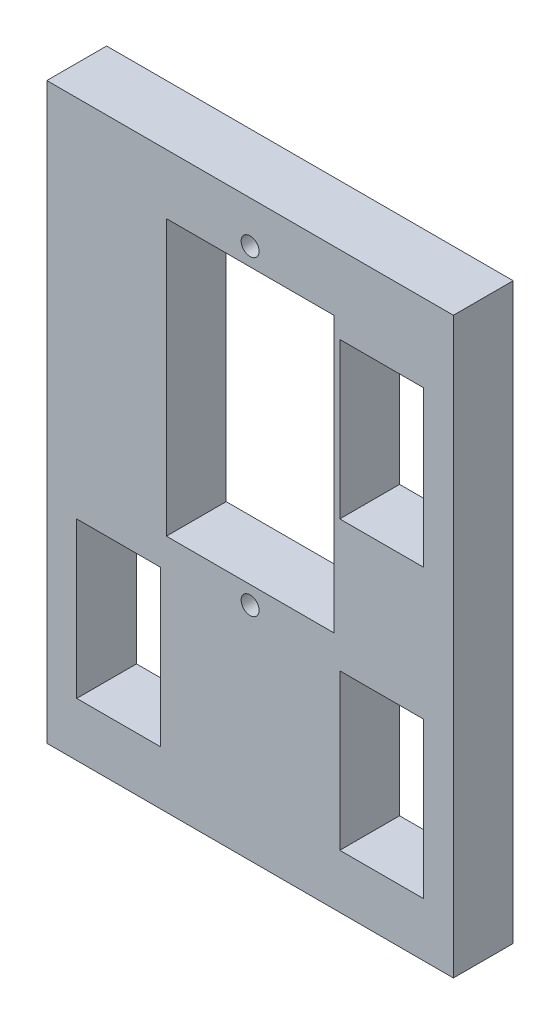
ISO-10303-21;
HEADER;
FILE_DESCRIPTION(('STEP AP214'),'2;1');
FILE_NAME('part.step','',(''),(''),'','','');
FILE_SCHEMA(('AUTOMOTIVE_DESIGN { 1 0 10303 214 1 1 1 1 }'));
ENDSEC;
DATA;
#1=APPLICATION_CONTEXT('core data for automotive mechanical design processes');
#2=APPLICATION_PROTOCOL_DEFINITION('international standard','automotive_design',2000,#1);
#3=PRODUCT_CONTEXT('',#1,'mechanical');
#4=PRODUCT('Part','Part','',(#3));
#5=PRODUCT_RELATED_PRODUCT_CATEGORY('part','',(#4));
#6=PRODUCT_DEFINITION_FORMATION('','',#4);
#7=PRODUCT_DEFINITION_CONTEXT('part definition',#1,'design');
#8=PRODUCT_DEFINITION('design','',#6,#7);
#9=PRODUCT_DEFINITION_SHAPE('','',#8);
#10=(LENGTH_UNIT() NAMED_UNIT(*) SI_UNIT(.MILLI.,.METRE.));
#11=(NAMED_UNIT(*) PLANE_ANGLE_UNIT() SI_UNIT($,.RADIAN.));
#12=(NAMED_UNIT(*) SI_UNIT($,.STERADIAN.) SOLID_ANGLE_UNIT());
#13=UNCERTAINTY_MEASURE_WITH_UNIT(LENGTH_MEASURE(1.E-05),#10,'distance_accuracy_value','');
#14=(GEOMETRIC_REPRESENTATION_CONTEXT(3) GLOBAL_UNCERTAINTY_ASSIGNED_CONTEXT((#13)) GLOBAL_UNIT_ASSIGNED_CONTEXT((#10,
#11,#12)) REPRESENTATION_CONTEXT('',''));
#15=CARTESIAN_POINT('',(0.,0.,0.));
#16=DIRECTION('',(0.,0.,1.));
#17=DIRECTION('',(1.,0.,0.));
#18=AXIS2_PLACEMENT_3D('',#15,#16,#17);
#19=CARTESIAN_POINT('',(0.,0.,5.));
#20=DIRECTION('',(0.,0.,-1.));
#21=DIRECTION('',(-1.,0.,0.));
#22=AXIS2_PLACEMENT_3D('',#19,#20,#21);
#23=PLANE('',#22);
#24=DIRECTION('',(0.,1.,0.));
#25=VECTOR('',#24,1.);
#26=CARTESIAN_POINT('',(31.5,28.5,5.));
#27=LINE('',#26,#25);
#28=CARTESIAN_POINT('',(31.5,28.5,5.));
#29=VERTEX_POINT('',#28);
#30=CARTESIAN_POINT('',(31.5,41.5,5.));
#31=VERTEX_POINT('',#30);
#32=EDGE_CURVE('E206',#29,#31,#27,.T.);
#33=ORIENTED_EDGE('',*,*,#32,.F.);
#34=DIRECTION('',(1.,0.,0.));
#35=VECTOR('',#34,1.);
#36=CARTESIAN_POINT('',(31.5,28.5,5.));
#37=LINE('',#36,#35);
#38=CARTESIAN_POINT('',(24.5,28.5,5.));
#39=VERTEX_POINT('',#38);
#40=EDGE_CURVE('E214',#39,#29,#37,.T.);
#41=ORIENTED_EDGE('',*,*,#40,.F.);
#42=DIRECTION('',(0.,-1.,0.));
#43=VECTOR('',#42,1.);
#44=CARTESIAN_POINT('',(24.5,28.5,5.));
#45=LINE('',#44,#43);
#46=CARTESIAN_POINT('',(24.5,41.5,5.));
#47=VERTEX_POINT('',#46);
#48=EDGE_CURVE('E211',#47,#39,#45,.T.);
#49=ORIENTED_EDGE('',*,*,#48,.F.);
#50=DIRECTION('',(-1.,0.,0.));
#51=VECTOR('',#50,1.);
#52=CARTESIAN_POINT('',(31.5,41.5,5.));
#53=LINE('',#52,#51);
#54=EDGE_CURVE('E208',#31,#47,#53,.T.);
#55=ORIENTED_EDGE('',*,*,#54,.F.);
#56=EDGE_LOOP('',(#33,#41,#49,#55));
#57=FACE_BOUND('',#56,.T.);
#58=CARTESIAN_POINT('',(17.,44.5,5.));
#59=DIRECTION('',(0.,0.,1.));
#60=DIRECTION('',(1.,0.,0.));
#61=AXIS2_PLACEMENT_3D('',#58,#59,#60);
#62=CIRCLE('',#61,0.750000000000002);
#63=CARTESIAN_POINT('',(17.75,44.5,5.));
#64=VERTEX_POINT('',#63);
#65=EDGE_CURVE('E268',#64,#64,#62,.T.);
#66=ORIENTED_EDGE('',*,*,#65,.F.);
#67=EDGE_LOOP('',(#66));
#68=FACE_BOUND('',#67,.T.);
#69=CARTESIAN_POINT('',(17.,18.5,5.));
#70=DIRECTION('',(0.,0.,1.));
#71=DIRECTION('',(1.,0.,0.));
#72=AXIS2_PLACEMENT_3D('',#69,#70,#71);
#73=CIRCLE('',#72,0.750000000000002);
#74=CARTESIAN_POINT('',(17.75,18.5,5.));
#75=VERTEX_POINT('',#74);
#76=EDGE_CURVE('E274',#75,#75,#73,.T.);
#77=ORIENTED_EDGE('',*,*,#76,.F.);
#78=EDGE_LOOP('',(#77));
#79=FACE_BOUND('',#78,.T.);
#80=DIRECTION('',(0.,-1.,0.));
#81=VECTOR('',#80,1.);
#82=CARTESIAN_POINT('',(10.,20.,5.));
#83=LINE('',#82,#81);
#84=CARTESIAN_POINT('',(10.,43.,5.));
#85=VERTEX_POINT('',#84);
#86=CARTESIAN_POINT('',(10.,20.,5.));
#87=VERTEX_POINT('',#86);
#88=EDGE_CURVE('E280',#85,#87,#83,.T.);
#89=ORIENTED_EDGE('',*,*,#88,.F.);
#90=DIRECTION('',(-1.,0.,0.));
#91=VECTOR('',#90,1.);
#92=CARTESIAN_POINT('',(24.,43.,5.));
#93=LINE('',#92,#91);
#94=CARTESIAN_POINT('',(24.,43.,5.));
#95=VERTEX_POINT('',#94);
#96=EDGE_CURVE('E288',#95,#85,#93,.T.);
#97=ORIENTED_EDGE('',*,*,#96,.F.);
#98=DIRECTION('',(0.,1.,0.));
#99=VECTOR('',#98,1.);
#100=CARTESIAN_POINT('',(24.,20.,5.));
#101=LINE('',#100,#99);
#102=CARTESIAN_POINT('',(24.,20.,5.));
#103=VERTEX_POINT('',#102);
#104=EDGE_CURVE('E285',#103,#95,#101,.T.);
#105=ORIENTED_EDGE('',*,*,#104,.F.);
#106=DIRECTION('',(1.,0.,0.));
#107=VECTOR('',#106,1.);
#108=CARTESIAN_POINT('',(24.,20.,5.));
#109=LINE('',#108,#107);
#110=EDGE_CURVE('E282',#87,#103,#109,.T.);
#111=ORIENTED_EDGE('',*,*,#110,.F.);
#112=EDGE_LOOP('',(#89,#97,#105,#111));
#113=FACE_BOUND('',#112,.T.);
#114=DIRECTION('',(0.,-1.,0.));
#115=VECTOR('',#114,1.);
#116=CARTESIAN_POINT('',(0.,0.,5.));
#117=LINE('',#116,#115);
#118=CARTESIAN_POINT('',(0.,48.,5.));
#119=VERTEX_POINT('',#118);
#120=CARTESIAN_POINT('',(0.,0.,5.));
#121=VERTEX_POINT('',#120);
#122=EDGE_CURVE('E311',#119,#121,#117,.T.);
#123=ORIENTED_EDGE('',*,*,#122,.T.);
#124=DIRECTION('',(1.,0.,0.));
#125=VECTOR('',#124,1.);
#126=CARTESIAN_POINT('',(0.,0.,5.));
#127=LINE('',#126,#125);
#128=CARTESIAN_POINT('',(34.,0.,5.));
#129=VERTEX_POINT('',#128);
#130=EDGE_CURVE('E314',#121,#129,#127,.T.);
#131=ORIENTED_EDGE('',*,*,#130,.T.);
#132=DIRECTION('',(0.,1.,0.));
#133=VECTOR('',#132,1.);
#134=CARTESIAN_POINT('',(34.,0.,5.));
#135=LINE('',#134,#133);
#136=CARTESIAN_POINT('',(34.,48.,5.));
#137=VERTEX_POINT('',#136);
#138=EDGE_CURVE('E317',#129,#137,#135,.T.);
#139=ORIENTED_EDGE('',*,*,#138,.T.);
#140=DIRECTION('',(-1.,0.,0.));
#141=VECTOR('',#140,1.);
#142=CARTESIAN_POINT('',(0.,48.,5.));
#143=LINE('',#142,#141);
#144=EDGE_CURVE('E319',#137,#119,#143,.T.);
#145=ORIENTED_EDGE('',*,*,#144,.T.);
#146=EDGE_LOOP('',(#123,#131,#139,#145));
#147=FACE_BOUND('',#146,.T.);
#148=DIRECTION('',(0.,1.,0.));
#149=VECTOR('',#148,1.);
#150=CARTESIAN_POINT('',(31.5,4.5,5.));
#151=LINE('',#150,#149);
#152=CARTESIAN_POINT('',(31.5,4.5,5.));
#153=VERTEX_POINT('',#152);
#154=CARTESIAN_POINT('',(31.5,17.5,5.));
#155=VERTEX_POINT('',#154);
#156=EDGE_CURVE('E237',#153,#155,#151,.T.);
#157=ORIENTED_EDGE('',*,*,#156,.F.);
#158=DIRECTION('',(1.,0.,0.));
#159=VECTOR('',#158,1.);
#160=CARTESIAN_POINT('',(31.5,4.5,5.));
#161=LINE('',#160,#159);
#162=CARTESIAN_POINT('',(24.5,4.5,5.));
#163=VERTEX_POINT('',#162);
#164=EDGE_CURVE('E245',#163,#153,#161,.T.);
#165=ORIENTED_EDGE('',*,*,#164,.F.);
#166=DIRECTION('',(0.,-1.,0.));
#167=VECTOR('',#166,1.);
#168=CARTESIAN_POINT('',(24.5,4.5,5.));
#169=LINE('',#168,#167);
#170=CARTESIAN_POINT('',(24.5,17.5,5.));
#171=VERTEX_POINT('',#170);
#172=EDGE_CURVE('E242',#171,#163,#169,.T.);
#173=ORIENTED_EDGE('',*,*,#172,.F.);
#174=DIRECTION('',(-1.,0.,0.));
#175=VECTOR('',#174,1.);
#176=CARTESIAN_POINT('',(31.5,17.5,5.));
#177=LINE('',#176,#175);
#178=EDGE_CURVE('E239',#155,#171,#177,.T.);
#179=ORIENTED_EDGE('',*,*,#178,.F.);
#180=EDGE_LOOP('',(#157,#165,#173,#179));
#181=FACE_BOUND('',#180,.T.);
#182=DIRECTION('',(0.,1.,0.));
#183=VECTOR('',#182,1.);
#184=CARTESIAN_POINT('',(9.5,4.5,5.));
#185=LINE('',#184,#183);
#186=CARTESIAN_POINT('',(9.5,4.5,5.));
#187=VERTEX_POINT('',#186);
#188=CARTESIAN_POINT('',(9.49999999999999,17.5,5.));
#189=VERTEX_POINT('',#188);
#190=EDGE_CURVE('E170',#187,#189,#185,.T.);
#191=ORIENTED_EDGE('',*,*,#190,.F.);
#192=DIRECTION('',(1.,0.,0.));
#193=VECTOR('',#192,1.);
#194=CARTESIAN_POINT('',(9.5,4.5,5.));
#195=LINE('',#194,#193);
#196=CARTESIAN_POINT('',(2.5,4.5,5.));
#197=VERTEX_POINT('',#196);
#198=EDGE_CURVE('E192',#197,#187,#195,.T.);
#199=ORIENTED_EDGE('',*,*,#198,.F.);
#200=DIRECTION('',(0.,-1.,0.));
#201=VECTOR('',#200,1.);
#202=CARTESIAN_POINT('',(2.5,4.5,5.));
#203=LINE('',#202,#201);
#204=CARTESIAN_POINT('',(2.5,17.5,5.));
#205=VERTEX_POINT('',#204);
#206=EDGE_CURVE('E190',#205,#197,#203,.T.);
#207=ORIENTED_EDGE('',*,*,#206,.F.);
#208=DIRECTION('',(-1.,0.,0.));
#209=VECTOR('',#208,1.);
#210=CARTESIAN_POINT('',(9.49999999999999,17.5,5.));
#211=LINE('',#210,#209);
#212=EDGE_CURVE('E178',#189,#205,#211,.T.);
#213=ORIENTED_EDGE('',*,*,#212,.F.);
#214=EDGE_LOOP('',(#191,#199,#207,#213));
#215=FACE_BOUND('',#214,.T.);
#216=ADVANCED_FACE('F33',(#57,#68,#79,#113,#147,#181,#215),#23,.F.);
#217=CARTESIAN_POINT('',(0.,0.,0.));
#218=DIRECTION('',(0.,0.,-1.));
#219=DIRECTION('',(-1.,0.,0.));
#220=AXIS2_PLACEMENT_3D('',#217,#218,#219);
#221=PLANE('',#220);
#222=CARTESIAN_POINT('',(17.,18.5,0.));
#223=DIRECTION('',(0.,0.,1.));
#224=DIRECTION('',(1.,0.,0.));
#225=AXIS2_PLACEMENT_3D('',#222,#223,#224);
#226=CIRCLE('',#225,0.750000000000002);
#227=CARTESIAN_POINT('',(17.75,18.5,0.));
#228=VERTEX_POINT('',#227);
#229=EDGE_CURVE('E271',#228,#228,#226,.T.);
#230=ORIENTED_EDGE('',*,*,#229,.T.);
#231=EDGE_LOOP('',(#230));
#232=FACE_BOUND('',#231,.T.);
#233=DIRECTION('',(0.,-1.,0.));
#234=VECTOR('',#233,1.);
#235=CARTESIAN_POINT('',(0.,0.,0.));
#236=LINE('',#235,#234);
#237=CARTESIAN_POINT('',(0.,48.,0.));
#238=VERTEX_POINT('',#237);
#239=CARTESIAN_POINT('',(0.,0.,0.));
#240=VERTEX_POINT('',#239);
#241=EDGE_CURVE('E310',#238,#240,#236,.T.);
#242=ORIENTED_EDGE('',*,*,#241,.F.);
#243=DIRECTION('',(-1.,0.,0.));
#244=VECTOR('',#243,1.);
#245=CARTESIAN_POINT('',(0.,48.,0.));
#246=LINE('',#245,#244);
#247=CARTESIAN_POINT('',(34.,48.,0.));
#248=VERTEX_POINT('',#247);
#249=EDGE_CURVE('E315',#248,#238,#246,.T.);
#250=ORIENTED_EDGE('',*,*,#249,.F.);
#251=DIRECTION('',(0.,1.,0.));
#252=VECTOR('',#251,1.);
#253=CARTESIAN_POINT('',(34.,0.,0.));
#254=LINE('',#253,#252);
#255=CARTESIAN_POINT('',(34.,0.,0.));
#256=VERTEX_POINT('',#255);
#257=EDGE_CURVE('E326',#256,#248,#254,.T.);
#258=ORIENTED_EDGE('',*,*,#257,.F.);
#259=DIRECTION('',(1.,0.,0.));
#260=VECTOR('',#259,1.);
#261=CARTESIAN_POINT('',(0.,0.,0.));
#262=LINE('',#261,#260);
#263=EDGE_CURVE('E324',#240,#256,#262,.T.);
#264=ORIENTED_EDGE('',*,*,#263,.F.);
#265=EDGE_LOOP('',(#242,#250,#258,#264));
#266=FACE_BOUND('',#265,.T.);
#267=DIRECTION('',(-1.,0.,0.));
#268=VECTOR('',#267,1.);
#269=CARTESIAN_POINT('',(24.,43.,0.));
#270=LINE('',#269,#268);
#271=CARTESIAN_POINT('',(24.,43.,0.));
#272=VERTEX_POINT('',#271);
#273=CARTESIAN_POINT('',(10.,43.,0.));
#274=VERTEX_POINT('',#273);
#275=EDGE_CURVE('E283',#272,#274,#270,.T.);
#276=ORIENTED_EDGE('',*,*,#275,.T.);
#277=DIRECTION('',(0.,-1.,0.));
#278=VECTOR('',#277,1.);
#279=CARTESIAN_POINT('',(10.,20.,0.));
#280=LINE('',#279,#278);
#281=CARTESIAN_POINT('',(10.,20.,0.));
#282=VERTEX_POINT('',#281);
#283=EDGE_CURVE('E277',#274,#282,#280,.T.);
#284=ORIENTED_EDGE('',*,*,#283,.T.);
#285=DIRECTION('',(1.,0.,0.));
#286=VECTOR('',#285,1.);
#287=CARTESIAN_POINT('',(24.,20.,0.));
#288=LINE('',#287,#286);
#289=CARTESIAN_POINT('',(24.,20.,0.));
#290=VERTEX_POINT('',#289);
#291=EDGE_CURVE('E293',#282,#290,#288,.T.);
#292=ORIENTED_EDGE('',*,*,#291,.T.);
#293=DIRECTION('',(0.,1.,0.));
#294=VECTOR('',#293,1.);
#295=CARTESIAN_POINT('',(24.,20.,0.));
#296=LINE('',#295,#294);
#297=EDGE_CURVE('E296',#290,#272,#296,.T.);
#298=ORIENTED_EDGE('',*,*,#297,.T.);
#299=EDGE_LOOP('',(#276,#284,#292,#298));
#300=FACE_BOUND('',#299,.T.);
#301=CARTESIAN_POINT('',(17.,44.5,0.));
#302=DIRECTION('',(0.,0.,1.));
#303=DIRECTION('',(1.,0.,0.));
#304=AXIS2_PLACEMENT_3D('',#301,#302,#303);
#305=CIRCLE('',#304,0.750000000000002);
#306=CARTESIAN_POINT('',(17.75,44.5,0.));
#307=VERTEX_POINT('',#306);
#308=EDGE_CURVE('E267',#307,#307,#305,.T.);
#309=ORIENTED_EDGE('',*,*,#308,.T.);
#310=EDGE_LOOP('',(#309));
#311=FACE_BOUND('',#310,.T.);
#312=DIRECTION('',(1.,0.,0.));
#313=VECTOR('',#312,1.);
#314=CARTESIAN_POINT('',(31.5,4.5,0.));
#315=LINE('',#314,#313);
#316=CARTESIAN_POINT('',(24.5,4.5,0.));
#317=VERTEX_POINT('',#316);
#318=CARTESIAN_POINT('',(31.5,4.5,0.));
#319=VERTEX_POINT('',#318);
#320=EDGE_CURVE('E240',#317,#319,#315,.T.);
#321=ORIENTED_EDGE('',*,*,#320,.T.);
#322=DIRECTION('',(0.,1.,0.));
#323=VECTOR('',#322,1.);
#324=CARTESIAN_POINT('',(31.5,4.5,0.));
#325=LINE('',#324,#323);
#326=CARTESIAN_POINT('',(31.5,17.5,0.));
#327=VERTEX_POINT('',#326);
#328=EDGE_CURVE('E236',#319,#327,#325,.T.);
#329=ORIENTED_EDGE('',*,*,#328,.T.);
#330=DIRECTION('',(-1.,0.,0.));
#331=VECTOR('',#330,1.);
#332=CARTESIAN_POINT('',(31.5,17.5,0.));
#333=LINE('',#332,#331);
#334=CARTESIAN_POINT('',(24.5,17.5,0.));
#335=VERTEX_POINT('',#334);
#336=EDGE_CURVE('E250',#327,#335,#333,.T.);
#337=ORIENTED_EDGE('',*,*,#336,.T.);
#338=DIRECTION('',(0.,-1.,0.));
#339=VECTOR('',#338,1.);
#340=CARTESIAN_POINT('',(24.5,4.5,0.));
#341=LINE('',#340,#339);
#342=EDGE_CURVE('E253',#335,#317,#341,.T.);
#343=ORIENTED_EDGE('',*,*,#342,.T.);
#344=EDGE_LOOP('',(#321,#329,#337,#343));
#345=FACE_BOUND('',#344,.T.);
#346=DIRECTION('',(1.,0.,0.));
#347=VECTOR('',#346,1.);
#348=CARTESIAN_POINT('',(31.5,28.5,0.));
#349=LINE('',#348,#347);
#350=CARTESIAN_POINT('',(24.5,28.5,0.));
#351=VERTEX_POINT('',#350);
#352=CARTESIAN_POINT('',(31.5,28.5,0.));
#353=VERTEX_POINT('',#352);
#354=EDGE_CURVE('E209',#351,#353,#349,.T.);
#355=ORIENTED_EDGE('',*,*,#354,.T.);
#356=DIRECTION('',(0.,1.,0.));
#357=VECTOR('',#356,1.);
#358=CARTESIAN_POINT('',(31.5,28.5,0.));
#359=LINE('',#358,#357);
#360=CARTESIAN_POINT('',(31.5,41.5,0.));
#361=VERTEX_POINT('',#360);
#362=EDGE_CURVE('E186',#353,#361,#359,.T.);
#363=ORIENTED_EDGE('',*,*,#362,.T.);
#364=DIRECTION('',(-1.,0.,0.));
#365=VECTOR('',#364,1.);
#366=CARTESIAN_POINT('',(31.5,41.5,0.));
#367=LINE('',#366,#365);
#368=CARTESIAN_POINT('',(24.5,41.5,0.));
#369=VERTEX_POINT('',#368);
#370=EDGE_CURVE('E219',#361,#369,#367,.T.);
#371=ORIENTED_EDGE('',*,*,#370,.T.);
#372=DIRECTION('',(0.,-1.,0.));
#373=VECTOR('',#372,1.);
#374=CARTESIAN_POINT('',(24.5,28.5,0.));
#375=LINE('',#374,#373);
#376=EDGE_CURVE('E222',#369,#351,#375,.T.);
#377=ORIENTED_EDGE('',*,*,#376,.T.);
#378=EDGE_LOOP('',(#355,#363,#371,#377));
#379=FACE_BOUND('',#378,.T.);
#380=DIRECTION('',(1.,0.,0.));
#381=VECTOR('',#380,1.);
#382=CARTESIAN_POINT('',(9.5,4.5,0.));
#383=LINE('',#382,#381);
#384=CARTESIAN_POINT('',(2.5,4.5,0.));
#385=VERTEX_POINT('',#384);
#386=CARTESIAN_POINT('',(9.5,4.5,0.));
#387=VERTEX_POINT('',#386);
#388=EDGE_CURVE('E179',#385,#387,#383,.T.);
#389=ORIENTED_EDGE('',*,*,#388,.T.);
#390=DIRECTION('',(0.,1.,0.));
#391=VECTOR('',#390,1.);
#392=CARTESIAN_POINT('',(9.5,4.5,0.));
#393=LINE('',#392,#391);
#394=CARTESIAN_POINT('',(9.49999999999999,17.5,0.));
#395=VERTEX_POINT('',#394);
#396=EDGE_CURVE('E56',#387,#395,#393,.T.);
#397=ORIENTED_EDGE('',*,*,#396,.T.);
#398=DIRECTION('',(-1.,0.,0.));
#399=VECTOR('',#398,1.);
#400=CARTESIAN_POINT('',(9.49999999999999,17.5,0.));
#401=LINE('',#400,#399);
#402=CARTESIAN_POINT('',(2.5,17.5,0.));
#403=VERTEX_POINT('',#402);
#404=EDGE_CURVE('E185',#395,#403,#401,.T.);
#405=ORIENTED_EDGE('',*,*,#404,.T.);
#406=DIRECTION('',(0.,-1.,0.));
#407=VECTOR('',#406,1.);
#408=CARTESIAN_POINT('',(2.5,4.5,0.));
#409=LINE('',#408,#407);
#410=EDGE_CURVE('E198',#403,#385,#409,.T.);
#411=ORIENTED_EDGE('',*,*,#410,.T.);
#412=EDGE_LOOP('',(#389,#397,#405,#411));
#413=FACE_BOUND('',#412,.T.);
#414=ADVANCED_FACE('F344',(#232,#266,#300,#311,#345,#379,#413),#221,.T.);
#415=CARTESIAN_POINT('',(0.,0.,5.));
#416=DIRECTION('',(1.,0.,0.));
#417=DIRECTION('',(0.,0.,-1.));
#418=AXIS2_PLACEMENT_3D('',#415,#416,#417);
#419=PLANE('',#418);
#420=ORIENTED_EDGE('',*,*,#241,.T.);
#421=DIRECTION('',(0.,0.,-1.));
#422=VECTOR('',#421,1.);
#423=CARTESIAN_POINT('',(0.,0.,5.));
#424=LINE('',#423,#422);
#425=EDGE_CURVE('E11',#121,#240,#424,.T.);
#426=ORIENTED_EDGE('',*,*,#425,.F.);
#427=ORIENTED_EDGE('',*,*,#122,.F.);
#428=DIRECTION('',(0.,0.,-1.));
#429=VECTOR('',#428,1.);
#430=CARTESIAN_POINT('',(0.,48.,5.));
#431=LINE('',#430,#429);
#432=EDGE_CURVE('E321',#119,#238,#431,.T.);
#433=ORIENTED_EDGE('',*,*,#432,.T.);
#434=EDGE_LOOP('',(#420,#426,#427,#433));
#435=FACE_BOUND('',#434,.T.);
#436=ADVANCED_FACE('F35',(#435),#419,.F.);
#437=CARTESIAN_POINT('',(0.,0.,5.));
#438=DIRECTION('',(0.,1.,0.));
#439=DIRECTION('',(-1.,0.,0.));
#440=AXIS2_PLACEMENT_3D('',#437,#438,#439);
#441=PLANE('',#440);
#442=ORIENTED_EDGE('',*,*,#263,.T.);
#443=DIRECTION('',(0.,0.,-1.));
#444=VECTOR('',#443,1.);
#445=CARTESIAN_POINT('',(34.,0.,5.));
#446=LINE('',#445,#444);
#447=EDGE_CURVE('E41',#129,#256,#446,.T.);
#448=ORIENTED_EDGE('',*,*,#447,.F.);
#449=ORIENTED_EDGE('',*,*,#130,.F.);
#450=ORIENTED_EDGE('',*,*,#425,.T.);
#451=EDGE_LOOP('',(#442,#448,#449,#450));
#452=FACE_BOUND('',#451,.T.);
#453=ADVANCED_FACE('F355',(#452),#441,.F.);
#454=CARTESIAN_POINT('',(34.,0.,5.));
#455=DIRECTION('',(-1.,0.,0.));
#456=DIRECTION('',(0.,-1.,0.));
#457=AXIS2_PLACEMENT_3D('',#454,#455,#456);
#458=PLANE('',#457);
#459=ORIENTED_EDGE('',*,*,#257,.T.);
#460=DIRECTION('',(0.,0.,-1.));
#461=VECTOR('',#460,1.);
#462=CARTESIAN_POINT('',(34.,48.,5.));
#463=LINE('',#462,#461);
#464=EDGE_CURVE('E331',#137,#248,#463,.T.);
#465=ORIENTED_EDGE('',*,*,#464,.F.);
#466=ORIENTED_EDGE('',*,*,#138,.F.);
#467=ORIENTED_EDGE('',*,*,#447,.T.);
#468=EDGE_LOOP('',(#459,#465,#466,#467));
#469=FACE_BOUND('',#468,.T.);
#470=ADVANCED_FACE('F338',(#469),#458,.F.);
#471=CARTESIAN_POINT('',(0.,48.,5.));
#472=DIRECTION('',(0.,-1.,0.));
#473=DIRECTION('',(1.,0.,0.));
#474=AXIS2_PLACEMENT_3D('',#471,#472,#473);
#475=PLANE('',#474);
#476=ORIENTED_EDGE('',*,*,#249,.T.);
#477=ORIENTED_EDGE('',*,*,#432,.F.);
#478=ORIENTED_EDGE('',*,*,#144,.F.);
#479=ORIENTED_EDGE('',*,*,#464,.T.);
#480=EDGE_LOOP('',(#476,#477,#478,#479));
#481=FACE_BOUND('',#480,.T.);
#482=ADVANCED_FACE('F348',(#481),#475,.F.);
#483=CARTESIAN_POINT('',(10.,20.,5.));
#484=DIRECTION('',(1.,0.,0.));
#485=DIRECTION('',(0.,0.,-1.));
#486=AXIS2_PLACEMENT_3D('',#483,#484,#485);
#487=PLANE('',#486);
#488=ORIENTED_EDGE('',*,*,#283,.F.);
#489=DIRECTION('',(0.,0.,-1.));
#490=VECTOR('',#489,1.);
#491=CARTESIAN_POINT('',(10.,43.,5.));
#492=LINE('',#491,#490);
#493=EDGE_CURVE('E290',#85,#274,#492,.T.);
#494=ORIENTED_EDGE('',*,*,#493,.F.);
#495=ORIENTED_EDGE('',*,*,#88,.T.);
#496=DIRECTION('',(0.,0.,-1.));
#497=VECTOR('',#496,1.);
#498=CARTESIAN_POINT('',(10.,20.,5.));
#499=LINE('',#498,#497);
#500=EDGE_CURVE('E307',#87,#282,#499,.T.);
#501=ORIENTED_EDGE('',*,*,#500,.T.);
#502=EDGE_LOOP('',(#488,#494,#495,#501));
#503=FACE_BOUND('',#502,.T.);
#504=ADVANCED_FACE('F373',(#503),#487,.T.);
#505=CARTESIAN_POINT('',(24.,20.,5.));
#506=DIRECTION('',(0.,1.,0.));
#507=DIRECTION('',(0.,0.,1.));
#508=AXIS2_PLACEMENT_3D('',#505,#506,#507);
#509=PLANE('',#508);
#510=ORIENTED_EDGE('',*,*,#291,.F.);
#511=ORIENTED_EDGE('',*,*,#500,.F.);
#512=ORIENTED_EDGE('',*,*,#110,.T.);
#513=DIRECTION('',(0.,0.,-1.));
#514=VECTOR('',#513,1.);
#515=CARTESIAN_POINT('',(24.,20.,5.));
#516=LINE('',#515,#514);
#517=EDGE_CURVE('E305',#103,#290,#516,.T.);
#518=ORIENTED_EDGE('',*,*,#517,.T.);
#519=EDGE_LOOP('',(#510,#511,#512,#518));
#520=FACE_BOUND('',#519,.T.);
#521=ADVANCED_FACE('F380',(#520),#509,.T.);
#522=CARTESIAN_POINT('',(24.,20.,5.));
#523=DIRECTION('',(-1.,0.,0.));
#524=DIRECTION('',(0.,0.,1.));
#525=AXIS2_PLACEMENT_3D('',#522,#523,#524);
#526=PLANE('',#525);
#527=ORIENTED_EDGE('',*,*,#297,.F.);
#528=ORIENTED_EDGE('',*,*,#517,.F.);
#529=ORIENTED_EDGE('',*,*,#104,.T.);
#530=DIRECTION('',(0.,0.,-1.));
#531=VECTOR('',#530,1.);
#532=CARTESIAN_POINT('',(24.,43.,5.));
#533=LINE('',#532,#531);
#534=EDGE_CURVE('E303',#95,#272,#533,.T.);
#535=ORIENTED_EDGE('',*,*,#534,.T.);
#536=EDGE_LOOP('',(#527,#528,#529,#535));
#537=FACE_BOUND('',#536,.T.);
#538=ADVANCED_FACE('F385',(#537),#526,.T.);
#539=CARTESIAN_POINT('',(24.,43.,5.));
#540=DIRECTION('',(0.,-1.,0.));
#541=DIRECTION('',(0.,0.,-1.));
#542=AXIS2_PLACEMENT_3D('',#539,#540,#541);
#543=PLANE('',#542);
#544=ORIENTED_EDGE('',*,*,#275,.F.);
#545=ORIENTED_EDGE('',*,*,#534,.F.);
#546=ORIENTED_EDGE('',*,*,#96,.T.);
#547=ORIENTED_EDGE('',*,*,#493,.T.);
#548=EDGE_LOOP('',(#544,#545,#546,#547));
#549=FACE_BOUND('',#548,.T.);
#550=ADVANCED_FACE('F392',(#549),#543,.T.);
#551=CARTESIAN_POINT('',(17.,18.5,5.));
#552=DIRECTION('',(0.,0.,-1.));
#553=DIRECTION('',(-1.,0.,0.));
#554=AXIS2_PLACEMENT_3D('',#551,#552,#553);
#555=CYLINDRICAL_SURFACE('',#554,0.750000000000002);
#556=ORIENTED_EDGE('',*,*,#76,.T.);
#557=EDGE_LOOP('',(#556));
#558=FACE_BOUND('',#557,.T.);
#559=ORIENTED_EDGE('',*,*,#229,.F.);
#560=EDGE_LOOP('',(#559));
#561=FACE_BOUND('',#560,.T.);
#562=ADVANCED_FACE('F406',(#558,#561),#555,.F.);
#563=CARTESIAN_POINT('',(17.,44.5,5.));
#564=DIRECTION('',(0.,0.,-1.));
#565=DIRECTION('',(-1.,0.,0.));
#566=AXIS2_PLACEMENT_3D('',#563,#564,#565);
#567=CYLINDRICAL_SURFACE('',#566,0.750000000000002);
#568=ORIENTED_EDGE('',*,*,#65,.T.);
#569=EDGE_LOOP('',(#568));
#570=FACE_BOUND('',#569,.T.);
#571=ORIENTED_EDGE('',*,*,#308,.F.);
#572=EDGE_LOOP('',(#571));
#573=FACE_BOUND('',#572,.T.);
#574=ADVANCED_FACE('F411',(#570,#573),#567,.F.);
#575=CARTESIAN_POINT('',(31.5,4.5,5.));
#576=DIRECTION('',(-1.,0.,0.));
#577=DIRECTION('',(0.,0.,1.));
#578=AXIS2_PLACEMENT_3D('',#575,#576,#577);
#579=PLANE('',#578);
#580=ORIENTED_EDGE('',*,*,#328,.F.);
#581=DIRECTION('',(0.,0.,-1.));
#582=VECTOR('',#581,1.);
#583=CARTESIAN_POINT('',(31.5,4.5,5.));
#584=LINE('',#583,#582);
#585=EDGE_CURVE('E247',#153,#319,#584,.T.);
#586=ORIENTED_EDGE('',*,*,#585,.F.);
#587=ORIENTED_EDGE('',*,*,#156,.T.);
#588=DIRECTION('',(0.,0.,-1.));
#589=VECTOR('',#588,1.);
#590=CARTESIAN_POINT('',(31.5,17.5,5.));
#591=LINE('',#590,#589);
#592=EDGE_CURVE('E264',#155,#327,#591,.T.);
#593=ORIENTED_EDGE('',*,*,#592,.T.);
#594=EDGE_LOOP('',(#580,#586,#587,#593));
#595=FACE_BOUND('',#594,.T.);
#596=ADVANCED_FACE('F415',(#595),#579,.T.);
#597=CARTESIAN_POINT('',(31.5,17.5,5.));
#598=DIRECTION('',(0.,-1.,0.));
#599=DIRECTION('',(1.,0.,0.));
#600=AXIS2_PLACEMENT_3D('',#597,#598,#599);
#601=PLANE('',#600);
#602=ORIENTED_EDGE('',*,*,#336,.F.);
#603=ORIENTED_EDGE('',*,*,#592,.F.);
#604=ORIENTED_EDGE('',*,*,#178,.T.);
#605=DIRECTION('',(0.,0.,-1.));
#606=VECTOR('',#605,1.);
#607=CARTESIAN_POINT('',(24.5,17.5,5.));
#608=LINE('',#607,#606);
#609=EDGE_CURVE('E262',#171,#335,#608,.T.);
#610=ORIENTED_EDGE('',*,*,#609,.T.);
#611=EDGE_LOOP('',(#602,#603,#604,#610));
#612=FACE_BOUND('',#611,.T.);
#613=ADVANCED_FACE('F419',(#612),#601,.T.);
#614=CARTESIAN_POINT('',(24.5,4.5,5.));
#615=DIRECTION('',(1.,0.,0.));
#616=DIRECTION('',(0.,0.,-1.));
#617=AXIS2_PLACEMENT_3D('',#614,#615,#616);
#618=PLANE('',#617);
#619=ORIENTED_EDGE('',*,*,#342,.F.);
#620=ORIENTED_EDGE('',*,*,#609,.F.);
#621=ORIENTED_EDGE('',*,*,#172,.T.);
#622=DIRECTION('',(0.,0.,-1.));
#623=VECTOR('',#622,1.);
#624=CARTESIAN_POINT('',(24.5,4.5,5.));
#625=LINE('',#624,#623);
#626=EDGE_CURVE('E260',#163,#317,#625,.T.);
#627=ORIENTED_EDGE('',*,*,#626,.T.);
#628=EDGE_LOOP('',(#619,#620,#621,#627));
#629=FACE_BOUND('',#628,.T.);
#630=ADVANCED_FACE('F423',(#629),#618,.T.);
#631=CARTESIAN_POINT('',(31.5,4.5,5.));
#632=DIRECTION('',(0.,1.,0.));
#633=DIRECTION('',(-1.,0.,0.));
#634=AXIS2_PLACEMENT_3D('',#631,#632,#633);
#635=PLANE('',#634);
#636=ORIENTED_EDGE('',*,*,#320,.F.);
#637=ORIENTED_EDGE('',*,*,#626,.F.);
#638=ORIENTED_EDGE('',*,*,#164,.T.);
#639=ORIENTED_EDGE('',*,*,#585,.T.);
#640=EDGE_LOOP('',(#636,#637,#638,#639));
#641=FACE_BOUND('',#640,.T.);
#642=ADVANCED_FACE('F427',(#641),#635,.T.);
#643=CARTESIAN_POINT('',(31.5,28.5,5.));
#644=DIRECTION('',(-1.,0.,0.));
#645=DIRECTION('',(0.,0.,1.));
#646=AXIS2_PLACEMENT_3D('',#643,#644,#645);
#647=PLANE('',#646);
#648=ORIENTED_EDGE('',*,*,#362,.F.);
#649=DIRECTION('',(0.,0.,-1.));
#650=VECTOR('',#649,1.);
#651=CARTESIAN_POINT('',(31.5,28.5,5.));
#652=LINE('',#651,#650);
#653=EDGE_CURVE('E216',#29,#353,#652,.T.);
#654=ORIENTED_EDGE('',*,*,#653,.F.);
#655=ORIENTED_EDGE('',*,*,#32,.T.);
#656=DIRECTION('',(0.,0.,-1.));
#657=VECTOR('',#656,1.);
#658=CARTESIAN_POINT('',(31.5,41.5,5.));
#659=LINE('',#658,#657);
#660=EDGE_CURVE('E233',#31,#361,#659,.T.);
#661=ORIENTED_EDGE('',*,*,#660,.T.);
#662=EDGE_LOOP('',(#648,#654,#655,#661));
#663=FACE_BOUND('',#662,.T.);
#664=ADVANCED_FACE('F431',(#663),#647,.T.);
#665=CARTESIAN_POINT('',(31.5,41.5,5.));
#666=DIRECTION('',(0.,-1.,0.));
#667=DIRECTION('',(0.,0.,-1.));
#668=AXIS2_PLACEMENT_3D('',#665,#666,#667);
#669=PLANE('',#668);
#670=ORIENTED_EDGE('',*,*,#370,.F.);
#671=ORIENTED_EDGE('',*,*,#660,.F.);
#672=ORIENTED_EDGE('',*,*,#54,.T.);
#673=DIRECTION('',(0.,0.,-1.));
#674=VECTOR('',#673,1.);
#675=CARTESIAN_POINT('',(24.5,41.5,5.));
#676=LINE('',#675,#674);
#677=EDGE_CURVE('E231',#47,#369,#676,.T.);
#678=ORIENTED_EDGE('',*,*,#677,.T.);
#679=EDGE_LOOP('',(#670,#671,#672,#678));
#680=FACE_BOUND('',#679,.T.);
#681=ADVANCED_FACE('F435',(#680),#669,.T.);
#682=CARTESIAN_POINT('',(24.5,28.5,5.));
#683=DIRECTION('',(1.,0.,0.));
#684=DIRECTION('',(0.,0.,-1.));
#685=AXIS2_PLACEMENT_3D('',#682,#683,#684);
#686=PLANE('',#685);
#687=ORIENTED_EDGE('',*,*,#376,.F.);
#688=ORIENTED_EDGE('',*,*,#677,.F.);
#689=ORIENTED_EDGE('',*,*,#48,.T.);
#690=DIRECTION('',(0.,0.,-1.));
#691=VECTOR('',#690,1.);
#692=CARTESIAN_POINT('',(24.5,28.5,5.));
#693=LINE('',#692,#691);
#694=EDGE_CURVE('E229',#39,#351,#693,.T.);
#695=ORIENTED_EDGE('',*,*,#694,.T.);
#696=EDGE_LOOP('',(#687,#688,#689,#695));
#697=FACE_BOUND('',#696,.T.);
#698=ADVANCED_FACE('F439',(#697),#686,.T.);
#699=CARTESIAN_POINT('',(31.5,28.5,5.));
#700=DIRECTION('',(0.,1.,0.));
#701=DIRECTION('',(0.,0.,1.));
#702=AXIS2_PLACEMENT_3D('',#699,#700,#701);
#703=PLANE('',#702);
#704=ORIENTED_EDGE('',*,*,#354,.F.);
#705=ORIENTED_EDGE('',*,*,#694,.F.);
#706=ORIENTED_EDGE('',*,*,#40,.T.);
#707=ORIENTED_EDGE('',*,*,#653,.T.);
#708=EDGE_LOOP('',(#704,#705,#706,#707));
#709=FACE_BOUND('',#708,.T.);
#710=ADVANCED_FACE('F443',(#709),#703,.T.);
#711=CARTESIAN_POINT('',(9.5,4.5,5.));
#712=DIRECTION('',(-1.,0.,0.));
#713=DIRECTION('',(0.,-1.,0.));
#714=AXIS2_PLACEMENT_3D('',#711,#712,#713);
#715=PLANE('',#714);
#716=ORIENTED_EDGE('',*,*,#396,.F.);
#717=DIRECTION('',(0.,0.,-1.));
#718=VECTOR('',#717,1.);
#719=CARTESIAN_POINT('',(9.5,4.5,5.));
#720=LINE('',#719,#718);
#721=EDGE_CURVE('E174',#187,#387,#720,.T.);
#722=ORIENTED_EDGE('',*,*,#721,.F.);
#723=ORIENTED_EDGE('',*,*,#190,.T.);
#724=DIRECTION('',(0.,0.,-1.));
#725=VECTOR('',#724,1.);
#726=CARTESIAN_POINT('',(9.49999999999999,17.5,5.));
#727=LINE('',#726,#725);
#728=EDGE_CURVE('E173',#189,#395,#727,.T.);
#729=ORIENTED_EDGE('',*,*,#728,.T.);
#730=EDGE_LOOP('',(#716,#722,#723,#729));
#731=FACE_BOUND('',#730,.T.);
#732=ADVANCED_FACE('F172',(#731),#715,.T.);
#733=CARTESIAN_POINT('',(9.49999999999999,17.5,5.));
#734=DIRECTION('',(0.,-1.,0.));
#735=DIRECTION('',(1.,0.,0.));
#736=AXIS2_PLACEMENT_3D('',#733,#734,#735);
#737=PLANE('',#736);
#738=ORIENTED_EDGE('',*,*,#404,.F.);
#739=ORIENTED_EDGE('',*,*,#728,.F.);
#740=ORIENTED_EDGE('',*,*,#212,.T.);
#741=DIRECTION('',(0.,0.,-1.));
#742=VECTOR('',#741,1.);
#743=CARTESIAN_POINT('',(2.5,17.5,5.));
#744=LINE('',#743,#742);
#745=EDGE_CURVE('E187',#205,#403,#744,.T.);
#746=ORIENTED_EDGE('',*,*,#745,.T.);
#747=EDGE_LOOP('',(#738,#739,#740,#746));
#748=FACE_BOUND('',#747,.T.);
#749=ADVANCED_FACE('F182',(#748),#737,.T.);
#750=CARTESIAN_POINT('',(2.5,4.5,5.));
#751=DIRECTION('',(1.,0.,0.));
#752=DIRECTION('',(0.,0.,-1.));
#753=AXIS2_PLACEMENT_3D('',#750,#751,#752);
#754=PLANE('',#753);
#755=ORIENTED_EDGE('',*,*,#410,.F.);
#756=ORIENTED_EDGE('',*,*,#745,.F.);
#757=ORIENTED_EDGE('',*,*,#206,.T.);
#758=DIRECTION('',(0.,0.,-1.));
#759=VECTOR('',#758,1.);
#760=CARTESIAN_POINT('',(2.5,4.5,5.));
#761=LINE('',#760,#759);
#762=EDGE_CURVE('E48',#197,#385,#761,.T.);
#763=ORIENTED_EDGE('',*,*,#762,.T.);
#764=EDGE_LOOP('',(#755,#756,#757,#763));
#765=FACE_BOUND('',#764,.T.);
#766=ADVANCED_FACE('F452',(#765),#754,.T.);
#767=CARTESIAN_POINT('',(9.5,4.5,5.));
#768=DIRECTION('',(0.,1.,0.));
#769=DIRECTION('',(-1.,0.,0.));
#770=AXIS2_PLACEMENT_3D('',#767,#768,#769);
#771=PLANE('',#770);
#772=ORIENTED_EDGE('',*,*,#388,.F.);
#773=ORIENTED_EDGE('',*,*,#762,.F.);
#774=ORIENTED_EDGE('',*,*,#198,.T.);
#775=ORIENTED_EDGE('',*,*,#721,.T.);
#776=EDGE_LOOP('',(#772,#773,#774,#775));
#777=FACE_BOUND('',#776,.T.);
#778=ADVANCED_FACE('F455',(#777),#771,.T.);
#779=CLOSED_SHELL('',(#216,#414,#436,#453,#470,#482,#504,#521,#538,#550,#562,#574,#596,#613,
#630,#642,#664,#681,#698,#710,#732,#749,#766,#778));
#780=MANIFOLD_SOLID_BREP('B2',#779);
#781=ADVANCED_BREP_SHAPE_REPRESENTATION('',(#18,#780),#14);
#782=SHAPE_DEFINITION_REPRESENTATION(#9,#781);
ENDSEC;
END-ISO-10303-21;
